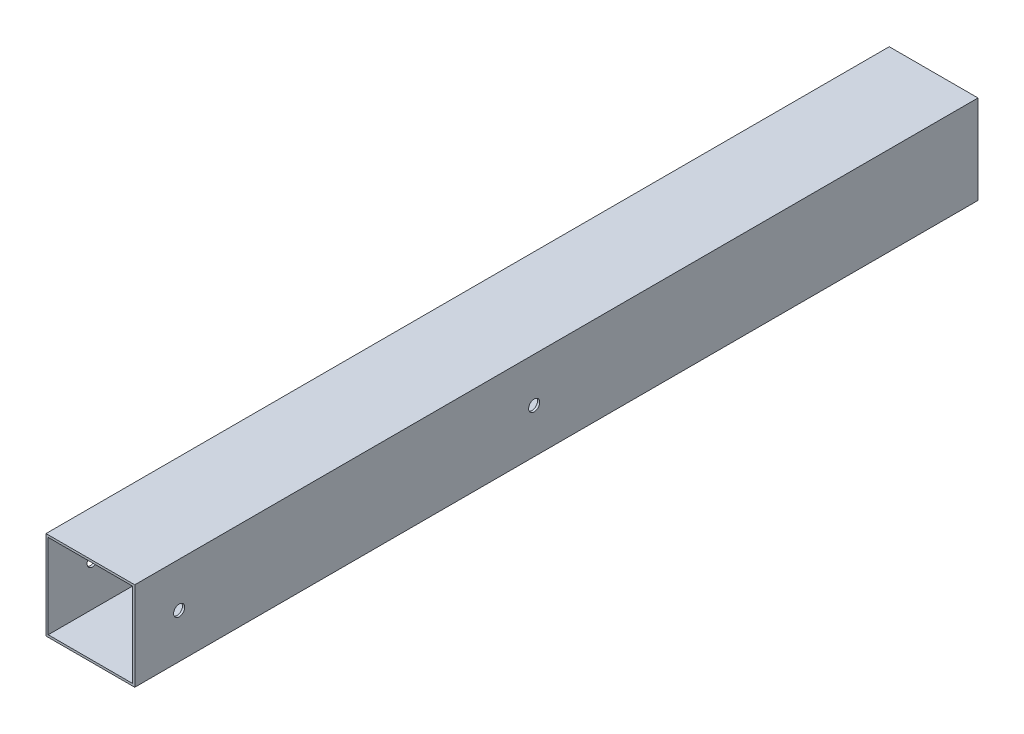
ISO-10303-21;
HEADER;
FILE_DESCRIPTION(('STEP AP214'),'2;1');
FILE_NAME('part.step','',(''),(''),'','','');
FILE_SCHEMA(('AUTOMOTIVE_DESIGN { 1 0 10303 214 1 1 1 1 }'));
ENDSEC;
DATA;
#1=APPLICATION_CONTEXT('core data for automotive mechanical design processes');
#2=APPLICATION_PROTOCOL_DEFINITION('international standard','automotive_design',2000,#1);
#3=PRODUCT_CONTEXT('',#1,'mechanical');
#4=PRODUCT('Part','Part','',(#3));
#5=PRODUCT_RELATED_PRODUCT_CATEGORY('part','',(#4));
#6=PRODUCT_DEFINITION_FORMATION('','',#4);
#7=PRODUCT_DEFINITION_CONTEXT('part definition',#1,'design');
#8=PRODUCT_DEFINITION('design','',#6,#7);
#9=PRODUCT_DEFINITION_SHAPE('','',#8);
#10=(LENGTH_UNIT() NAMED_UNIT(*) SI_UNIT(.MILLI.,.METRE.));
#11=(NAMED_UNIT(*) PLANE_ANGLE_UNIT() SI_UNIT($,.RADIAN.));
#12=(NAMED_UNIT(*) SI_UNIT($,.STERADIAN.) SOLID_ANGLE_UNIT());
#13=UNCERTAINTY_MEASURE_WITH_UNIT(LENGTH_MEASURE(1.E-05),#10,'distance_accuracy_value','');
#14=(GEOMETRIC_REPRESENTATION_CONTEXT(3) GLOBAL_UNCERTAINTY_ASSIGNED_CONTEXT((#13)) GLOBAL_UNIT_ASSIGNED_CONTEXT((#10,
#11,#12)) REPRESENTATION_CONTEXT('',''));
#15=CARTESIAN_POINT('',(0.,0.,0.));
#16=DIRECTION('',(0.,0.,1.));
#17=DIRECTION('',(1.,0.,0.));
#18=AXIS2_PLACEMENT_3D('',#15,#16,#17);
#19=CARTESIAN_POINT('',(0.,0.,380.));
#20=DIRECTION('',(0.,0.,1.));
#21=DIRECTION('',(1.,0.,0.));
#22=AXIS2_PLACEMENT_3D('',#19,#20,#21);
#23=PLANE('',#22);
#24=DIRECTION('',(0.,1.,0.));
#25=VECTOR('',#24,1.);
#26=CARTESIAN_POINT('',(20.,20.,380.));
#27=LINE('',#26,#25);
#28=CARTESIAN_POINT('',(20.,-20.,380.));
#29=VERTEX_POINT('',#28);
#30=CARTESIAN_POINT('',(20.,20.,380.));
#31=VERTEX_POINT('',#30);
#32=EDGE_CURVE('E138',#29,#31,#27,.T.);
#33=ORIENTED_EDGE('',*,*,#32,.T.);
#34=DIRECTION('',(-1.,0.,0.));
#35=VECTOR('',#34,1.);
#36=CARTESIAN_POINT('',(-20.,20.,380.));
#37=LINE('',#36,#35);
#38=CARTESIAN_POINT('',(-20.,20.,380.));
#39=VERTEX_POINT('',#38);
#40=EDGE_CURVE('E141',#31,#39,#37,.T.);
#41=ORIENTED_EDGE('',*,*,#40,.T.);
#42=DIRECTION('',(0.,-1.,0.));
#43=VECTOR('',#42,1.);
#44=CARTESIAN_POINT('',(-20.,20.,380.));
#45=LINE('',#44,#43);
#46=CARTESIAN_POINT('',(-20.,-20.,380.));
#47=VERTEX_POINT('',#46);
#48=EDGE_CURVE('E144',#39,#47,#45,.T.);
#49=ORIENTED_EDGE('',*,*,#48,.T.);
#50=DIRECTION('',(1.,0.,0.));
#51=VECTOR('',#50,1.);
#52=CARTESIAN_POINT('',(-20.,-20.,380.));
#53=LINE('',#52,#51);
#54=EDGE_CURVE('E146',#47,#29,#53,.T.);
#55=ORIENTED_EDGE('',*,*,#54,.T.);
#56=EDGE_LOOP('',(#33,#41,#49,#55));
#57=FACE_BOUND('',#56,.T.);
#58=DIRECTION('',(1.,0.,0.));
#59=VECTOR('',#58,1.);
#60=CARTESIAN_POINT('',(19.,-19.,380.));
#61=LINE('',#60,#59);
#62=CARTESIAN_POINT('',(-19.,-19.,380.));
#63=VERTEX_POINT('',#62);
#64=CARTESIAN_POINT('',(19.,-19.,380.));
#65=VERTEX_POINT('',#64);
#66=EDGE_CURVE('E108',#63,#65,#61,.T.);
#67=ORIENTED_EDGE('',*,*,#66,.F.);
#68=DIRECTION('',(0.,-1.,0.));
#69=VECTOR('',#68,1.);
#70=CARTESIAN_POINT('',(-19.,-19.,380.));
#71=LINE('',#70,#69);
#72=CARTESIAN_POINT('',(-19.,19.,380.));
#73=VERTEX_POINT('',#72);
#74=EDGE_CURVE('E100',#73,#63,#71,.T.);
#75=ORIENTED_EDGE('',*,*,#74,.F.);
#76=DIRECTION('',(-1.,0.,0.));
#77=VECTOR('',#76,1.);
#78=CARTESIAN_POINT('',(19.,19.,380.));
#79=LINE('',#78,#77);
#80=CARTESIAN_POINT('',(19.,19.,380.));
#81=VERTEX_POINT('',#80);
#82=EDGE_CURVE('E122',#81,#73,#79,.T.);
#83=ORIENTED_EDGE('',*,*,#82,.F.);
#84=DIRECTION('',(0.,1.,0.));
#85=VECTOR('',#84,1.);
#86=CARTESIAN_POINT('',(19.,-19.,380.));
#87=LINE('',#86,#85);
#88=EDGE_CURVE('E120',#65,#81,#87,.T.);
#89=ORIENTED_EDGE('',*,*,#88,.F.);
#90=EDGE_LOOP('',(#67,#75,#83,#89));
#91=FACE_BOUND('',#90,.T.);
#92=ADVANCED_FACE('F33',(#57,#91),#23,.T.);
#93=CARTESIAN_POINT('',(0.,0.,0.));
#94=DIRECTION('',(0.,0.,1.));
#95=DIRECTION('',(1.,0.,0.));
#96=AXIS2_PLACEMENT_3D('',#93,#94,#95);
#97=PLANE('',#96);
#98=DIRECTION('',(0.,1.,0.));
#99=VECTOR('',#98,1.);
#100=CARTESIAN_POINT('',(20.,20.,0.));
#101=LINE('',#100,#99);
#102=CARTESIAN_POINT('',(20.,-20.,0.));
#103=VERTEX_POINT('',#102);
#104=CARTESIAN_POINT('',(20.,20.,0.));
#105=VERTEX_POINT('',#104);
#106=EDGE_CURVE('E116',#103,#105,#101,.T.);
#107=ORIENTED_EDGE('',*,*,#106,.F.);
#108=DIRECTION('',(1.,0.,0.));
#109=VECTOR('',#108,1.);
#110=CARTESIAN_POINT('',(-20.,-20.,0.));
#111=LINE('',#110,#109);
#112=CARTESIAN_POINT('',(-20.,-20.,0.));
#113=VERTEX_POINT('',#112);
#114=EDGE_CURVE('E142',#113,#103,#111,.T.);
#115=ORIENTED_EDGE('',*,*,#114,.F.);
#116=DIRECTION('',(0.,-1.,0.));
#117=VECTOR('',#116,1.);
#118=CARTESIAN_POINT('',(-20.,20.,0.));
#119=LINE('',#118,#117);
#120=CARTESIAN_POINT('',(-20.,20.,0.));
#121=VERTEX_POINT('',#120);
#122=EDGE_CURVE('E153',#121,#113,#119,.T.);
#123=ORIENTED_EDGE('',*,*,#122,.F.);
#124=DIRECTION('',(-1.,0.,0.));
#125=VECTOR('',#124,1.);
#126=CARTESIAN_POINT('',(-20.,20.,0.));
#127=LINE('',#126,#125);
#128=EDGE_CURVE('E151',#105,#121,#127,.T.);
#129=ORIENTED_EDGE('',*,*,#128,.F.);
#130=EDGE_LOOP('',(#107,#115,#123,#129));
#131=FACE_BOUND('',#130,.T.);
#132=DIRECTION('',(0.,-1.,0.));
#133=VECTOR('',#132,1.);
#134=CARTESIAN_POINT('',(-19.,-19.,0.));
#135=LINE('',#134,#133);
#136=CARTESIAN_POINT('',(-19.,19.,0.));
#137=VERTEX_POINT('',#136);
#138=CARTESIAN_POINT('',(-19.,-19.,0.));
#139=VERTEX_POINT('',#138);
#140=EDGE_CURVE('E58',#137,#139,#135,.T.);
#141=ORIENTED_EDGE('',*,*,#140,.T.);
#142=DIRECTION('',(1.,0.,0.));
#143=VECTOR('',#142,1.);
#144=CARTESIAN_POINT('',(19.,-19.,0.));
#145=LINE('',#144,#143);
#146=CARTESIAN_POINT('',(19.,-19.,0.));
#147=VERTEX_POINT('',#146);
#148=EDGE_CURVE('E115',#139,#147,#145,.T.);
#149=ORIENTED_EDGE('',*,*,#148,.T.);
#150=DIRECTION('',(0.,1.,0.));
#151=VECTOR('',#150,1.);
#152=CARTESIAN_POINT('',(19.,-19.,0.));
#153=LINE('',#152,#151);
#154=CARTESIAN_POINT('',(19.,19.,0.));
#155=VERTEX_POINT('',#154);
#156=EDGE_CURVE('E130',#147,#155,#153,.T.);
#157=ORIENTED_EDGE('',*,*,#156,.T.);
#158=DIRECTION('',(-1.,0.,0.));
#159=VECTOR('',#158,1.);
#160=CARTESIAN_POINT('',(19.,19.,0.));
#161=LINE('',#160,#159);
#162=EDGE_CURVE('E109',#155,#137,#161,.T.);
#163=ORIENTED_EDGE('',*,*,#162,.T.);
#164=EDGE_LOOP('',(#141,#149,#157,#163));
#165=FACE_BOUND('',#164,.T.);
#166=ADVANCED_FACE('F200',(#131,#165),#97,.F.);
#167=CARTESIAN_POINT('',(20.,20.,380.));
#168=DIRECTION('',(-1.,0.,0.));
#169=DIRECTION('',(0.,0.,1.));
#170=AXIS2_PLACEMENT_3D('',#167,#168,#169);
#171=PLANE('',#170);
#172=CARTESIAN_POINT('',(20.,0.,200.));
#173=DIRECTION('',(1.,0.,0.));
#174=DIRECTION('',(0.,0.,-1.));
#175=AXIS2_PLACEMENT_3D('',#172,#173,#174);
#176=CIRCLE('',#175,2.5);
#177=CARTESIAN_POINT('',(20.,0.,197.5));
#178=VERTEX_POINT('',#177);
#179=EDGE_CURVE('E179',#178,#178,#176,.T.);
#180=ORIENTED_EDGE('',*,*,#179,.F.);
#181=EDGE_LOOP('',(#180));
#182=FACE_BOUND('',#181,.T.);
#183=CARTESIAN_POINT('',(20.,0.,360.));
#184=DIRECTION('',(1.,0.,0.));
#185=DIRECTION('',(0.,0.,-1.));
#186=AXIS2_PLACEMENT_3D('',#183,#184,#185);
#187=CIRCLE('',#186,2.50000000000002);
#188=CARTESIAN_POINT('',(20.,0.,357.5));
#189=VERTEX_POINT('',#188);
#190=EDGE_CURVE('E169',#189,#189,#187,.T.);
#191=ORIENTED_EDGE('',*,*,#190,.F.);
#192=EDGE_LOOP('',(#191));
#193=FACE_BOUND('',#192,.T.);
#194=ORIENTED_EDGE('',*,*,#106,.T.);
#195=DIRECTION('',(0.,0.,-1.));
#196=VECTOR('',#195,1.);
#197=CARTESIAN_POINT('',(20.,20.,380.));
#198=LINE('',#197,#196);
#199=EDGE_CURVE('E11',#31,#105,#198,.T.);
#200=ORIENTED_EDGE('',*,*,#199,.F.);
#201=ORIENTED_EDGE('',*,*,#32,.F.);
#202=DIRECTION('',(0.,0.,-1.));
#203=VECTOR('',#202,1.);
#204=CARTESIAN_POINT('',(20.,-20.,380.));
#205=LINE('',#204,#203);
#206=EDGE_CURVE('E148',#29,#103,#205,.T.);
#207=ORIENTED_EDGE('',*,*,#206,.T.);
#208=EDGE_LOOP('',(#194,#200,#201,#207));
#209=FACE_BOUND('',#208,.T.);
#210=ADVANCED_FACE('F35',(#182,#193,#209),#171,.F.);
#211=CARTESIAN_POINT('',(-20.,20.,380.));
#212=DIRECTION('',(0.,-1.,0.));
#213=DIRECTION('',(0.,0.,-1.));
#214=AXIS2_PLACEMENT_3D('',#211,#212,#213);
#215=PLANE('',#214);
#216=ORIENTED_EDGE('',*,*,#128,.T.);
#217=DIRECTION('',(0.,0.,-1.));
#218=VECTOR('',#217,1.);
#219=CARTESIAN_POINT('',(-20.,20.,380.));
#220=LINE('',#219,#218);
#221=EDGE_CURVE('E42',#39,#121,#220,.T.);
#222=ORIENTED_EDGE('',*,*,#221,.F.);
#223=ORIENTED_EDGE('',*,*,#40,.F.);
#224=ORIENTED_EDGE('',*,*,#199,.T.);
#225=EDGE_LOOP('',(#216,#222,#223,#224));
#226=FACE_BOUND('',#225,.T.);
#227=ADVANCED_FACE('F226',(#226),#215,.F.);
#228=CARTESIAN_POINT('',(-20.,20.,380.));
#229=DIRECTION('',(1.,0.,0.));
#230=DIRECTION('',(0.,1.,0.));
#231=AXIS2_PLACEMENT_3D('',#228,#229,#230);
#232=PLANE('',#231);
#233=CARTESIAN_POINT('',(-20.,0.,200.));
#234=DIRECTION('',(1.,0.,0.));
#235=DIRECTION('',(0.,0.,-1.));
#236=AXIS2_PLACEMENT_3D('',#233,#234,#235);
#237=CIRCLE('',#236,2.5);
#238=CARTESIAN_POINT('',(-20.,0.,197.5));
#239=VERTEX_POINT('',#238);
#240=EDGE_CURVE('E182',#239,#239,#237,.T.);
#241=ORIENTED_EDGE('',*,*,#240,.T.);
#242=EDGE_LOOP('',(#241));
#243=FACE_BOUND('',#242,.T.);
#244=CARTESIAN_POINT('',(-20.,0.,360.));
#245=DIRECTION('',(1.,0.,0.));
#246=DIRECTION('',(0.,0.,-1.));
#247=AXIS2_PLACEMENT_3D('',#244,#245,#246);
#248=CIRCLE('',#247,2.50000000000002);
#249=CARTESIAN_POINT('',(-20.,0.,357.5));
#250=VERTEX_POINT('',#249);
#251=EDGE_CURVE('E164',#250,#250,#248,.T.);
#252=ORIENTED_EDGE('',*,*,#251,.T.);
#253=EDGE_LOOP('',(#252));
#254=FACE_BOUND('',#253,.T.);
#255=ORIENTED_EDGE('',*,*,#122,.T.);
#256=DIRECTION('',(0.,0.,-1.));
#257=VECTOR('',#256,1.);
#258=CARTESIAN_POINT('',(-20.,-20.,380.));
#259=LINE('',#258,#257);
#260=EDGE_CURVE('E158',#47,#113,#259,.T.);
#261=ORIENTED_EDGE('',*,*,#260,.F.);
#262=ORIENTED_EDGE('',*,*,#48,.F.);
#263=ORIENTED_EDGE('',*,*,#221,.T.);
#264=EDGE_LOOP('',(#255,#261,#262,#263));
#265=FACE_BOUND('',#264,.T.);
#266=ADVANCED_FACE('F223',(#243,#254,#265),#232,.F.);
#267=CARTESIAN_POINT('',(-20.,-20.,380.));
#268=DIRECTION('',(0.,1.,0.));
#269=DIRECTION('',(0.,0.,1.));
#270=AXIS2_PLACEMENT_3D('',#267,#268,#269);
#271=PLANE('',#270);
#272=ORIENTED_EDGE('',*,*,#114,.T.);
#273=ORIENTED_EDGE('',*,*,#206,.F.);
#274=ORIENTED_EDGE('',*,*,#54,.F.);
#275=ORIENTED_EDGE('',*,*,#260,.T.);
#276=EDGE_LOOP('',(#272,#273,#274,#275));
#277=FACE_BOUND('',#276,.T.);
#278=ADVANCED_FACE('F220',(#277),#271,.F.);
#279=CARTESIAN_POINT('',(-19.,-19.,380.));
#280=DIRECTION('',(1.,0.,0.));
#281=DIRECTION('',(0.,0.,-1.));
#282=AXIS2_PLACEMENT_3D('',#279,#280,#281);
#283=PLANE('',#282);
#284=CARTESIAN_POINT('',(-19.,0.,200.));
#285=DIRECTION('',(1.,0.,0.));
#286=DIRECTION('',(0.,0.,-1.));
#287=AXIS2_PLACEMENT_3D('',#284,#285,#286);
#288=CIRCLE('',#287,2.5);
#289=CARTESIAN_POINT('',(-19.,0.,197.5));
#290=VERTEX_POINT('',#289);
#291=EDGE_CURVE('E174',#290,#290,#288,.T.);
#292=ORIENTED_EDGE('',*,*,#291,.F.);
#293=EDGE_LOOP('',(#292));
#294=FACE_BOUND('',#293,.T.);
#295=CARTESIAN_POINT('',(-19.,0.,360.));
#296=DIRECTION('',(1.,0.,0.));
#297=DIRECTION('',(0.,0.,-1.));
#298=AXIS2_PLACEMENT_3D('',#295,#296,#297);
#299=CIRCLE('',#298,2.50000000000002);
#300=CARTESIAN_POINT('',(-19.,0.,357.5));
#301=VERTEX_POINT('',#300);
#302=EDGE_CURVE('E128',#301,#301,#299,.T.);
#303=ORIENTED_EDGE('',*,*,#302,.F.);
#304=EDGE_LOOP('',(#303));
#305=FACE_BOUND('',#304,.T.);
#306=ORIENTED_EDGE('',*,*,#140,.F.);
#307=DIRECTION('',(0.,0.,-1.));
#308=VECTOR('',#307,1.);
#309=CARTESIAN_POINT('',(-19.,19.,380.));
#310=LINE('',#309,#308);
#311=EDGE_CURVE('E104',#73,#137,#310,.T.);
#312=ORIENTED_EDGE('',*,*,#311,.F.);
#313=ORIENTED_EDGE('',*,*,#74,.T.);
#314=DIRECTION('',(0.,0.,-1.));
#315=VECTOR('',#314,1.);
#316=CARTESIAN_POINT('',(-19.,-19.,380.));
#317=LINE('',#316,#315);
#318=EDGE_CURVE('E103',#63,#139,#317,.T.);
#319=ORIENTED_EDGE('',*,*,#318,.T.);
#320=EDGE_LOOP('',(#306,#312,#313,#319));
#321=FACE_BOUND('',#320,.T.);
#322=ADVANCED_FACE('F102',(#294,#305,#321),#283,.T.);
#323=CARTESIAN_POINT('',(19.,-19.,380.));
#324=DIRECTION('',(0.,1.,0.));
#325=DIRECTION('',(-1.,0.,0.));
#326=AXIS2_PLACEMENT_3D('',#323,#324,#325);
#327=PLANE('',#326);
#328=ORIENTED_EDGE('',*,*,#148,.F.);
#329=ORIENTED_EDGE('',*,*,#318,.F.);
#330=ORIENTED_EDGE('',*,*,#66,.T.);
#331=DIRECTION('',(0.,0.,-1.));
#332=VECTOR('',#331,1.);
#333=CARTESIAN_POINT('',(19.,-19.,380.));
#334=LINE('',#333,#332);
#335=EDGE_CURVE('E117',#65,#147,#334,.T.);
#336=ORIENTED_EDGE('',*,*,#335,.T.);
#337=EDGE_LOOP('',(#328,#329,#330,#336));
#338=FACE_BOUND('',#337,.T.);
#339=ADVANCED_FACE('F112',(#338),#327,.T.);
#340=CARTESIAN_POINT('',(19.,-19.,380.));
#341=DIRECTION('',(-1.,0.,0.));
#342=DIRECTION('',(0.,0.,1.));
#343=AXIS2_PLACEMENT_3D('',#340,#341,#342);
#344=PLANE('',#343);
#345=CARTESIAN_POINT('',(19.,0.,200.));
#346=DIRECTION('',(-1.,0.,0.));
#347=DIRECTION('',(0.,0.,1.));
#348=AXIS2_PLACEMENT_3D('',#345,#346,#347);
#349=CIRCLE('',#348,2.5);
#350=CARTESIAN_POINT('',(19.,0.,202.5));
#351=VERTEX_POINT('',#350);
#352=EDGE_CURVE('E37',#351,#351,#349,.T.);
#353=ORIENTED_EDGE('',*,*,#352,.F.);
#354=EDGE_LOOP('',(#353));
#355=FACE_BOUND('',#354,.T.);
#356=CARTESIAN_POINT('',(19.,0.,360.));
#357=DIRECTION('',(-1.,0.,0.));
#358=DIRECTION('',(0.,0.,1.));
#359=AXIS2_PLACEMENT_3D('',#356,#357,#358);
#360=CIRCLE('',#359,2.50000000000002);
#361=CARTESIAN_POINT('',(19.,0.,362.5));
#362=VERTEX_POINT('',#361);
#363=EDGE_CURVE('E162',#362,#362,#360,.T.);
#364=ORIENTED_EDGE('',*,*,#363,.F.);
#365=EDGE_LOOP('',(#364));
#366=FACE_BOUND('',#365,.T.);
#367=ORIENTED_EDGE('',*,*,#156,.F.);
#368=ORIENTED_EDGE('',*,*,#335,.F.);
#369=ORIENTED_EDGE('',*,*,#88,.T.);
#370=DIRECTION('',(0.,0.,-1.));
#371=VECTOR('',#370,1.);
#372=CARTESIAN_POINT('',(19.,19.,380.));
#373=LINE('',#372,#371);
#374=EDGE_CURVE('E50',#81,#155,#373,.T.);
#375=ORIENTED_EDGE('',*,*,#374,.T.);
#376=EDGE_LOOP('',(#367,#368,#369,#375));
#377=FACE_BOUND('',#376,.T.);
#378=ADVANCED_FACE('F192',(#355,#366,#377),#344,.T.);
#379=CARTESIAN_POINT('',(19.,19.,380.));
#380=DIRECTION('',(0.,-1.,0.));
#381=DIRECTION('',(0.,0.,-1.));
#382=AXIS2_PLACEMENT_3D('',#379,#380,#381);
#383=PLANE('',#382);
#384=ORIENTED_EDGE('',*,*,#162,.F.);
#385=ORIENTED_EDGE('',*,*,#374,.F.);
#386=ORIENTED_EDGE('',*,*,#82,.T.);
#387=ORIENTED_EDGE('',*,*,#311,.T.);
#388=EDGE_LOOP('',(#384,#385,#386,#387));
#389=FACE_BOUND('',#388,.T.);
#390=ADVANCED_FACE('F195',(#389),#383,.T.);
#391=CARTESIAN_POINT('',(-20.,0.,360.));
#392=DIRECTION('',(1.,0.,0.));
#393=DIRECTION('',(0.,0.,-1.));
#394=AXIS2_PLACEMENT_3D('',#391,#392,#393);
#395=CYLINDRICAL_SURFACE('',#394,2.50000000000002);
#396=ORIENTED_EDGE('',*,*,#363,.T.);
#397=EDGE_LOOP('',(#396));
#398=FACE_BOUND('',#397,.T.);
#399=ORIENTED_EDGE('',*,*,#190,.T.);
#400=EDGE_LOOP('',(#399));
#401=FACE_BOUND('',#400,.T.);
#402=ADVANCED_FACE('F202',(#398,#401),#395,.F.);
#403=ORIENTED_EDGE('',*,*,#302,.T.);
#404=EDGE_LOOP('',(#403));
#405=FACE_BOUND('',#404,.T.);
#406=ORIENTED_EDGE('',*,*,#251,.F.);
#407=EDGE_LOOP('',(#406));
#408=FACE_BOUND('',#407,.T.);
#409=ADVANCED_FACE('F207',(#405,#408),#395,.F.);
#410=CARTESIAN_POINT('',(-20.,0.,200.));
#411=DIRECTION('',(1.,0.,0.));
#412=DIRECTION('',(0.,0.,-1.));
#413=AXIS2_PLACEMENT_3D('',#410,#411,#412);
#414=CYLINDRICAL_SURFACE('',#413,2.5);
#415=ORIENTED_EDGE('',*,*,#352,.T.);
#416=EDGE_LOOP('',(#415));
#417=FACE_BOUND('',#416,.T.);
#418=ORIENTED_EDGE('',*,*,#179,.T.);
#419=EDGE_LOOP('',(#418));
#420=FACE_BOUND('',#419,.T.);
#421=ADVANCED_FACE('F189',(#417,#420),#414,.F.);
#422=ORIENTED_EDGE('',*,*,#291,.T.);
#423=EDGE_LOOP('',(#422));
#424=FACE_BOUND('',#423,.T.);
#425=ORIENTED_EDGE('',*,*,#240,.F.);
#426=EDGE_LOOP('',(#425));
#427=FACE_BOUND('',#426,.T.);
#428=ADVANCED_FACE('F252',(#424,#427),#414,.F.);
#429=CLOSED_SHELL('',(#92,#166,#210,#227,#266,#278,#322,#339,#378,#390,#402,#409,#421,#428));
#430=MANIFOLD_SOLID_BREP('B2',#429);
#431=ADVANCED_BREP_SHAPE_REPRESENTATION('',(#18,#430),#14);
#432=SHAPE_DEFINITION_REPRESENTATION(#9,#431);
ENDSEC;
END-ISO-10303-21;
